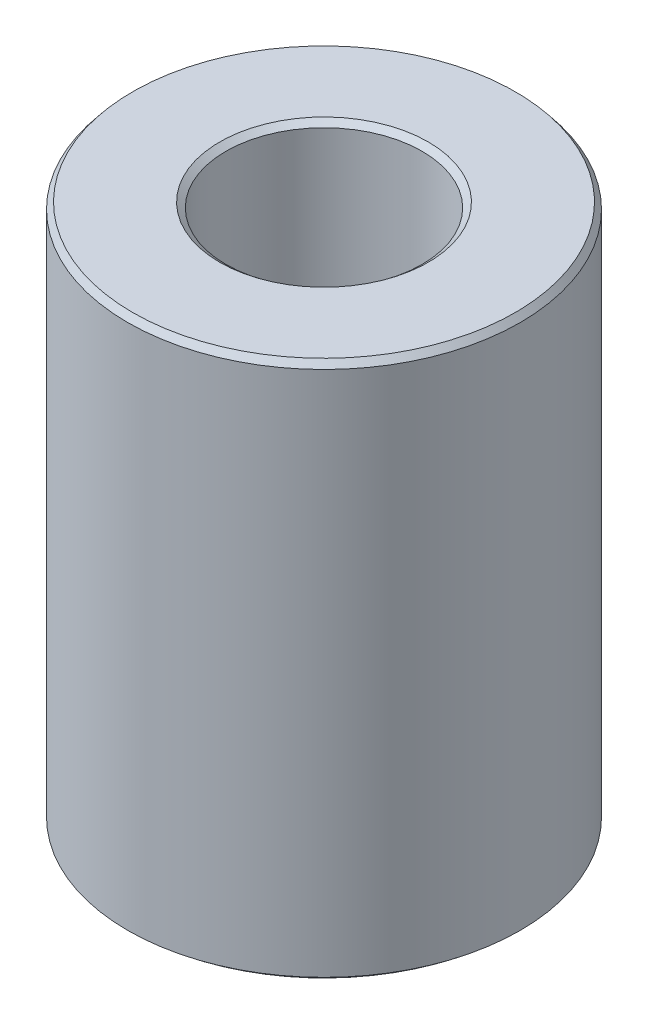
ISO-10303-21;
HEADER;
FILE_DESCRIPTION(('STEP AP214'),'2;1');
FILE_NAME('part.step','',(''),(''),'','','');
FILE_SCHEMA(('AUTOMOTIVE_DESIGN { 1 0 10303 214 1 1 1 1 }'));
ENDSEC;
DATA;
#1=APPLICATION_CONTEXT('core data for automotive mechanical design processes');
#2=APPLICATION_PROTOCOL_DEFINITION('international standard','automotive_design',2000,#1);
#3=PRODUCT_CONTEXT('',#1,'mechanical');
#4=PRODUCT('Part','Part','',(#3));
#5=PRODUCT_RELATED_PRODUCT_CATEGORY('part','',(#4));
#6=PRODUCT_DEFINITION_FORMATION('','',#4);
#7=PRODUCT_DEFINITION_CONTEXT('part definition',#1,'design');
#8=PRODUCT_DEFINITION('design','',#6,#7);
#9=PRODUCT_DEFINITION_SHAPE('','',#8);
#10=(LENGTH_UNIT() NAMED_UNIT(*) SI_UNIT(.MILLI.,.METRE.));
#11=(NAMED_UNIT(*) PLANE_ANGLE_UNIT() SI_UNIT($,.RADIAN.));
#12=(NAMED_UNIT(*) SI_UNIT($,.STERADIAN.) SOLID_ANGLE_UNIT());
#13=UNCERTAINTY_MEASURE_WITH_UNIT(LENGTH_MEASURE(1.E-05),#10,'distance_accuracy_value','');
#14=(GEOMETRIC_REPRESENTATION_CONTEXT(3) GLOBAL_UNCERTAINTY_ASSIGNED_CONTEXT((#13)) GLOBAL_UNIT_ASSIGNED_CONTEXT((#10,
#11,#12)) REPRESENTATION_CONTEXT('',''));
#15=CARTESIAN_POINT('',(0.,0.,0.));
#16=DIRECTION('',(0.,0.,1.));
#17=DIRECTION('',(1.,0.,0.));
#18=AXIS2_PLACEMENT_3D('',#15,#16,#17);
#19=CARTESIAN_POINT('',(0.,95.8868321464065,0.));
#20=DIRECTION('',(0.,-1.,0.));
#21=DIRECTION('',(0.,0.,-1.));
#22=AXIS2_PLACEMENT_3D('',#19,#20,#21);
#23=CYLINDRICAL_SURFACE('',#22,35.);
#24=CARTESIAN_POINT('',(0.,0.882135957126232,0.));
#25=DIRECTION('',(0.,1.,0.));
#26=DIRECTION('',(0.,0.,1.));
#27=AXIS2_PLACEMENT_3D('',#24,#25,#26);
#28=CIRCLE('',#27,35.);
#29=CARTESIAN_POINT('',(0.,0.882135957126232,35.));
#30=VERTEX_POINT('',#29);
#31=EDGE_CURVE('E10',#30,#30,#28,.T.);
#32=ORIENTED_EDGE('',*,*,#31,.T.);
#33=EDGE_LOOP('',(#32));
#34=FACE_BOUND('',#33,.T.);
#35=CARTESIAN_POINT('',(0.,94.7797493335526,0.));
#36=DIRECTION('',(0.,1.,0.));
#37=DIRECTION('',(0.,0.,1.));
#38=AXIS2_PLACEMENT_3D('',#35,#36,#37);
#39=CIRCLE('',#38,35.);
#40=CARTESIAN_POINT('',(0.,94.7797493335526,35.));
#41=VERTEX_POINT('',#40);
#42=EDGE_CURVE('E50',#41,#41,#39,.F.);
#43=ORIENTED_EDGE('',*,*,#42,.T.);
#44=EDGE_LOOP('',(#43));
#45=FACE_BOUND('',#44,.T.);
#46=ADVANCED_FACE('F39',(#34,#45),#23,.T.);
#47=CARTESIAN_POINT('',(0.,95.8868321464065,0.));
#48=DIRECTION('',(0.,1.,0.));
#49=DIRECTION('',(0.,0.,1.));
#50=AXIS2_PLACEMENT_3D('',#47,#48,#49);
#51=PLANE('',#50);
#52=CARTESIAN_POINT('',(0.,95.8868321464065,0.));
#53=DIRECTION('',(0.,1.,0.));
#54=DIRECTION('',(0.,0.,1.));
#55=AXIS2_PLACEMENT_3D('',#52,#53,#54);
#56=CIRCLE('',#55,18.5996310211932);
#57=CARTESIAN_POINT('',(0.,95.8868321464065,18.5996310211932));
#58=VERTEX_POINT('',#57);
#59=EDGE_CURVE('E58',#58,#58,#56,.F.);
#60=ORIENTED_EDGE('',*,*,#59,.T.);
#61=EDGE_LOOP('',(#60));
#62=FACE_BOUND('',#61,.T.);
#63=CARTESIAN_POINT('',(0.,95.8868321464065,0.));
#64=DIRECTION('',(0.,1.,0.));
#65=DIRECTION('',(0.,0.,1.));
#66=AXIS2_PLACEMENT_3D('',#63,#64,#65);
#67=CIRCLE('',#66,34.1178640428738);
#68=CARTESIAN_POINT('',(0.,95.8868321464065,34.1178640428738));
#69=VERTEX_POINT('',#68);
#70=EDGE_CURVE('E61',#69,#69,#67,.T.);
#71=ORIENTED_EDGE('',*,*,#70,.T.);
#72=EDGE_LOOP('',(#71));
#73=FACE_BOUND('',#72,.T.);
#74=ADVANCED_FACE('F88',(#62,#73),#51,.T.);
#75=CARTESIAN_POINT('',(0.,0.,0.));
#76=DIRECTION('',(0.,1.,0.));
#77=DIRECTION('',(0.,0.,1.));
#78=AXIS2_PLACEMENT_3D('',#75,#76,#77);
#79=PLANE('',#78);
#80=CARTESIAN_POINT('',(0.,0.,0.));
#81=DIRECTION('',(0.,1.,0.));
#82=DIRECTION('',(0.,0.,1.));
#83=AXIS2_PLACEMENT_3D('',#80,#81,#82);
#84=CIRCLE('',#83,18.3746841654655);
#85=CARTESIAN_POINT('',(0.,0.,18.3746841654655));
#86=VERTEX_POINT('',#85);
#87=EDGE_CURVE('E51',#86,#86,#84,.T.);
#88=ORIENTED_EDGE('',*,*,#87,.T.);
#89=EDGE_LOOP('',(#88));
#90=FACE_BOUND('',#89,.T.);
#91=CARTESIAN_POINT('',(0.,0.,0.));
#92=DIRECTION('',(0.,1.,0.));
#93=DIRECTION('',(0.,0.,1.));
#94=AXIS2_PLACEMENT_3D('',#91,#92,#93);
#95=CIRCLE('',#94,33.8929171871461);
#96=CARTESIAN_POINT('',(0.,0.,33.8929171871461));
#97=VERTEX_POINT('',#96);
#98=EDGE_CURVE('E54',#97,#97,#95,.F.);
#99=ORIENTED_EDGE('',*,*,#98,.T.);
#100=EDGE_LOOP('',(#99));
#101=FACE_BOUND('',#100,.T.);
#102=ADVANCED_FACE('F83',(#90,#101),#79,.F.);
#103=CARTESIAN_POINT('',(0.,95.8868321464065,0.));
#104=DIRECTION('',(0.,-1.,0.));
#105=DIRECTION('',(0.,0.,-1.));
#106=AXIS2_PLACEMENT_3D('',#103,#104,#105);
#107=CYLINDRICAL_SURFACE('',#106,17.4925482083393);
#108=CARTESIAN_POINT('',(0.,95.0046961892802,0.));
#109=DIRECTION('',(0.,1.,0.));
#110=DIRECTION('',(0.,0.,1.));
#111=AXIS2_PLACEMENT_3D('',#108,#109,#110);
#112=CIRCLE('',#111,17.4925482083393);
#113=CARTESIAN_POINT('',(0.,95.0046961892802,17.4925482083393));
#114=VERTEX_POINT('',#113);
#115=EDGE_CURVE('E67',#114,#114,#112,.T.);
#116=ORIENTED_EDGE('',*,*,#115,.T.);
#117=EDGE_LOOP('',(#116));
#118=FACE_BOUND('',#117,.T.);
#119=CARTESIAN_POINT('',(0.,1.10708281285388,0.));
#120=DIRECTION('',(0.,1.,0.));
#121=DIRECTION('',(0.,0.,1.));
#122=AXIS2_PLACEMENT_3D('',#119,#120,#121);
#123=CIRCLE('',#122,17.4925482083393);
#124=CARTESIAN_POINT('',(0.,1.10708281285388,17.4925482083393));
#125=VERTEX_POINT('',#124);
#126=EDGE_CURVE('E69',#125,#125,#123,.F.);
#127=ORIENTED_EDGE('',*,*,#126,.T.);
#128=EDGE_LOOP('',(#127));
#129=FACE_BOUND('',#128,.T.);
#130=ADVANCED_FACE('F71',(#118,#129),#107,.F.);
#131=CARTESIAN_POINT('',(0.,95.0046961892802,0.));
#132=DIRECTION('',(0.,1.,0.));
#133=DIRECTION('',(0.,0.,1.));
#134=AXIS2_PLACEMENT_3D('',#131,#132,#133);
#135=CONICAL_SURFACE('',#134,17.4925482083393,0.898002816772462);
#136=ORIENTED_EDGE('',*,*,#59,.F.);
#137=EDGE_LOOP('',(#136));
#138=FACE_BOUND('',#137,.T.);
#139=ORIENTED_EDGE('',*,*,#115,.F.);
#140=EDGE_LOOP('',(#139));
#141=FACE_BOUND('',#140,.T.);
#142=ADVANCED_FACE('F77',(#138,#141),#135,.F.);
#143=CARTESIAN_POINT('',(0.,0.,0.));
#144=DIRECTION('',(0.,-1.,0.));
#145=DIRECTION('',(0.,0.,-1.));
#146=AXIS2_PLACEMENT_3D('',#143,#144,#145);
#147=CONICAL_SURFACE('',#146,18.3746841654655,0.672793510022435);
#148=ORIENTED_EDGE('',*,*,#126,.F.);
#149=EDGE_LOOP('',(#148));
#150=FACE_BOUND('',#149,.T.);
#151=ORIENTED_EDGE('',*,*,#87,.F.);
#152=EDGE_LOOP('',(#151));
#153=FACE_BOUND('',#152,.T.);
#154=ADVANCED_FACE('F73',(#150,#153),#147,.F.);
#155=CARTESIAN_POINT('',(0.,0.882135957126232,0.));
#156=DIRECTION('',(0.,1.,0.));
#157=DIRECTION('',(0.,0.,1.));
#158=AXIS2_PLACEMENT_3D('',#155,#156,#157);
#159=CONICAL_SURFACE('',#158,35.,0.898002816772468);
#160=ORIENTED_EDGE('',*,*,#98,.F.);
#161=EDGE_LOOP('',(#160));
#162=FACE_BOUND('',#161,.T.);
#163=ORIENTED_EDGE('',*,*,#31,.F.);
#164=EDGE_LOOP('',(#163));
#165=FACE_BOUND('',#164,.T.);
#166=ADVANCED_FACE('F76',(#162,#165),#159,.T.);
#167=CARTESIAN_POINT('',(0.,95.8868321464065,0.));
#168=DIRECTION('',(0.,-1.,0.));
#169=DIRECTION('',(0.,0.,-1.));
#170=AXIS2_PLACEMENT_3D('',#167,#168,#169);
#171=CONICAL_SURFACE('',#170,34.1178640428738,0.672793510022434);
#172=ORIENTED_EDGE('',*,*,#42,.F.);
#173=EDGE_LOOP('',(#172));
#174=FACE_BOUND('',#173,.T.);
#175=ORIENTED_EDGE('',*,*,#70,.F.);
#176=EDGE_LOOP('',(#175));
#177=FACE_BOUND('',#176,.T.);
#178=ADVANCED_FACE('F45',(#174,#177),#171,.T.);
#179=CLOSED_SHELL('',(#46,#74,#102,#130,#142,#154,#166,#178));
#180=MANIFOLD_SOLID_BREP('B2',#179);
#181=ADVANCED_BREP_SHAPE_REPRESENTATION('',(#18,#180),#14);
#182=SHAPE_DEFINITION_REPRESENTATION(#9,#181);
ENDSEC;
END-ISO-10303-21;
